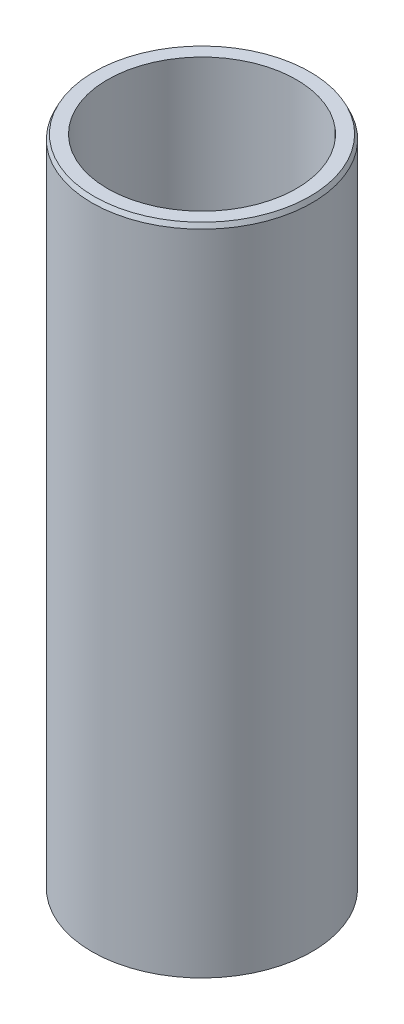
ISO-10303-21;
HEADER;
FILE_DESCRIPTION(('STEP AP214'),'2;1');
FILE_NAME('part.step','',(''),(''),'','','');
FILE_SCHEMA(('AUTOMOTIVE_DESIGN { 1 0 10303 214 1 1 1 1 }'));
ENDSEC;
DATA;
#1=APPLICATION_CONTEXT('core data for automotive mechanical design processes');
#2=APPLICATION_PROTOCOL_DEFINITION('international standard','automotive_design',2000,#1);
#3=PRODUCT_CONTEXT('',#1,'mechanical');
#4=PRODUCT('Part','Part','',(#3));
#5=PRODUCT_RELATED_PRODUCT_CATEGORY('part','',(#4));
#6=PRODUCT_DEFINITION_FORMATION('','',#4);
#7=PRODUCT_DEFINITION_CONTEXT('part definition',#1,'design');
#8=PRODUCT_DEFINITION('design','',#6,#7);
#9=PRODUCT_DEFINITION_SHAPE('','',#8);
#10=(LENGTH_UNIT() NAMED_UNIT(*) SI_UNIT(.MILLI.,.METRE.));
#11=(NAMED_UNIT(*) PLANE_ANGLE_UNIT() SI_UNIT($,.RADIAN.));
#12=(NAMED_UNIT(*) SI_UNIT($,.STERADIAN.) SOLID_ANGLE_UNIT());
#13=UNCERTAINTY_MEASURE_WITH_UNIT(LENGTH_MEASURE(1.E-05),#10,'distance_accuracy_value','');
#14=(GEOMETRIC_REPRESENTATION_CONTEXT(3) GLOBAL_UNCERTAINTY_ASSIGNED_CONTEXT((#13)) GLOBAL_UNIT_ASSIGNED_CONTEXT((#10,
#11,#12)) REPRESENTATION_CONTEXT('',''));
#15=CARTESIAN_POINT('',(0.,0.,0.));
#16=DIRECTION('',(0.,0.,1.));
#17=DIRECTION('',(1.,0.,0.));
#18=AXIS2_PLACEMENT_3D('',#15,#16,#17);
#19=CARTESIAN_POINT('',(0.,342.231668849559,0.));
#20=DIRECTION('',(0.,-1.,0.));
#21=DIRECTION('',(0.,0.,-1.));
#22=AXIS2_PLACEMENT_3D('',#19,#20,#21);
#23=CYLINDRICAL_SURFACE('',#22,57.5);
#24=CARTESIAN_POINT('',(0.,339.865030653866,0.));
#25=DIRECTION('',(0.,1.,0.));
#26=DIRECTION('',(0.,0.,1.));
#27=AXIS2_PLACEMENT_3D('',#24,#25,#26);
#28=CIRCLE('',#27,57.5);
#29=CARTESIAN_POINT('',(0.,339.865030653866,57.5));
#30=VERTEX_POINT('',#29);
#31=EDGE_CURVE('E50',#30,#30,#28,.F.);
#32=ORIENTED_EDGE('',*,*,#31,.T.);
#33=EDGE_LOOP('',(#32));
#34=FACE_BOUND('',#33,.T.);
#35=CARTESIAN_POINT('',(0.,1.11888142892036,0.));
#36=DIRECTION('',(0.,1.,0.));
#37=DIRECTION('',(0.,0.,1.));
#38=AXIS2_PLACEMENT_3D('',#35,#36,#37);
#39=CIRCLE('',#38,57.5);
#40=CARTESIAN_POINT('',(0.,1.11888142892036,57.5));
#41=VERTEX_POINT('',#40);
#42=EDGE_CURVE('E51',#41,#41,#39,.T.);
#43=ORIENTED_EDGE('',*,*,#42,.T.);
#44=EDGE_LOOP('',(#43));
#45=FACE_BOUND('',#44,.T.);
#46=ADVANCED_FACE('F39',(#34,#45),#23,.T.);
#47=CARTESIAN_POINT('',(0.,342.231668849559,0.));
#48=DIRECTION('',(0.,1.,0.));
#49=DIRECTION('',(0.,0.,1.));
#50=AXIS2_PLACEMENT_3D('',#47,#48,#49);
#51=PLANE('',#50);
#52=CARTESIAN_POINT('',(0.,342.231668849559,0.));
#53=DIRECTION('',(0.,1.,0.));
#54=DIRECTION('',(0.,0.,1.));
#55=AXIS2_PLACEMENT_3D('',#52,#53,#54);
#56=CIRCLE('',#55,56.3811185710796);
#57=CARTESIAN_POINT('',(0.,342.231668849559,56.3811185710796));
#58=VERTEX_POINT('',#57);
#59=EDGE_CURVE('E54',#58,#58,#56,.T.);
#60=ORIENTED_EDGE('',*,*,#59,.T.);
#61=EDGE_LOOP('',(#60));
#62=FACE_BOUND('',#61,.T.);
#63=CARTESIAN_POINT('',(0.,342.231668849559,0.));
#64=DIRECTION('',(0.,1.,0.));
#65=DIRECTION('',(0.,0.,1.));
#66=AXIS2_PLACEMENT_3D('',#63,#64,#65);
#67=CIRCLE('',#66,49.3284380269445);
#68=CARTESIAN_POINT('',(0.,342.231668849559,49.3284380269445));
#69=VERTEX_POINT('',#68);
#70=EDGE_CURVE('E58',#69,#69,#67,.T.);
#71=ORIENTED_EDGE('',*,*,#70,.F.);
#72=EDGE_LOOP('',(#71));
#73=FACE_BOUND('',#72,.T.);
#74=ADVANCED_FACE('F69',(#62,#73),#51,.T.);
#75=CARTESIAN_POINT('',(0.,0.,0.));
#76=DIRECTION('',(0.,1.,0.));
#77=DIRECTION('',(0.,0.,1.));
#78=AXIS2_PLACEMENT_3D('',#75,#76,#77);
#79=PLANE('',#78);
#80=CARTESIAN_POINT('',(0.,0.,0.));
#81=DIRECTION('',(0.,1.,0.));
#82=DIRECTION('',(0.,0.,1.));
#83=AXIS2_PLACEMENT_3D('',#80,#81,#82);
#84=CIRCLE('',#83,55.1333618043068);
#85=CARTESIAN_POINT('',(0.,0.,55.1333618043068));
#86=VERTEX_POINT('',#85);
#87=EDGE_CURVE('E10',#86,#86,#84,.F.);
#88=ORIENTED_EDGE('',*,*,#87,.T.);
#89=EDGE_LOOP('',(#88));
#90=FACE_BOUND('',#89,.T.);
#91=CARTESIAN_POINT('',(0.,0.,0.));
#92=DIRECTION('',(0.,1.,0.));
#93=DIRECTION('',(0.,0.,1.));
#94=AXIS2_PLACEMENT_3D('',#91,#92,#93);
#95=CIRCLE('',#94,49.3284380269445);
#96=CARTESIAN_POINT('',(0.,0.,49.3284380269445));
#97=VERTEX_POINT('',#96);
#98=EDGE_CURVE('E63',#97,#97,#95,.T.);
#99=ORIENTED_EDGE('',*,*,#98,.T.);
#100=EDGE_LOOP('',(#99));
#101=FACE_BOUND('',#100,.T.);
#102=ADVANCED_FACE('F75',(#90,#101),#79,.F.);
#103=CARTESIAN_POINT('',(0.,342.231668849559,0.));
#104=DIRECTION('',(0.,-1.,0.));
#105=DIRECTION('',(0.,0.,-1.));
#106=AXIS2_PLACEMENT_3D('',#103,#104,#105);
#107=CYLINDRICAL_SURFACE('',#106,49.3284380269445);
#108=ORIENTED_EDGE('',*,*,#70,.T.);
#109=EDGE_LOOP('',(#108));
#110=FACE_BOUND('',#109,.T.);
#111=ORIENTED_EDGE('',*,*,#98,.F.);
#112=EDGE_LOOP('',(#111));
#113=FACE_BOUND('',#112,.T.);
#114=ADVANCED_FACE('F70',(#110,#113),#107,.F.);
#115=CARTESIAN_POINT('',(0.,342.231668849559,0.));
#116=DIRECTION('',(0.,-1.,0.));
#117=DIRECTION('',(0.,0.,-1.));
#118=AXIS2_PLACEMENT_3D('',#115,#116,#117);
#119=CONICAL_SURFACE('',#118,56.3811185710796,0.441629318540843);
#120=ORIENTED_EDGE('',*,*,#31,.F.);
#121=EDGE_LOOP('',(#120));
#122=FACE_BOUND('',#121,.T.);
#123=ORIENTED_EDGE('',*,*,#59,.F.);
#124=EDGE_LOOP('',(#123));
#125=FACE_BOUND('',#124,.T.);
#126=ADVANCED_FACE('F81',(#122,#125),#119,.T.);
#127=CARTESIAN_POINT('',(0.,1.11888142892036,0.));
#128=DIRECTION('',(0.,1.,0.));
#129=DIRECTION('',(0.,0.,1.));
#130=AXIS2_PLACEMENT_3D('',#127,#128,#129);
#131=CONICAL_SURFACE('',#130,57.5,1.12916700825404);
#132=ORIENTED_EDGE('',*,*,#87,.F.);
#133=EDGE_LOOP('',(#132));
#134=FACE_BOUND('',#133,.T.);
#135=ORIENTED_EDGE('',*,*,#42,.F.);
#136=EDGE_LOOP('',(#135));
#137=FACE_BOUND('',#136,.T.);
#138=ADVANCED_FACE('F45',(#134,#137),#131,.T.);
#139=CLOSED_SHELL('',(#46,#74,#102,#114,#126,#138));
#140=MANIFOLD_SOLID_BREP('B2',#139);
#141=ADVANCED_BREP_SHAPE_REPRESENTATION('',(#18,#140),#14);
#142=SHAPE_DEFINITION_REPRESENTATION(#9,#141);
ENDSEC;
END-ISO-10303-21;
